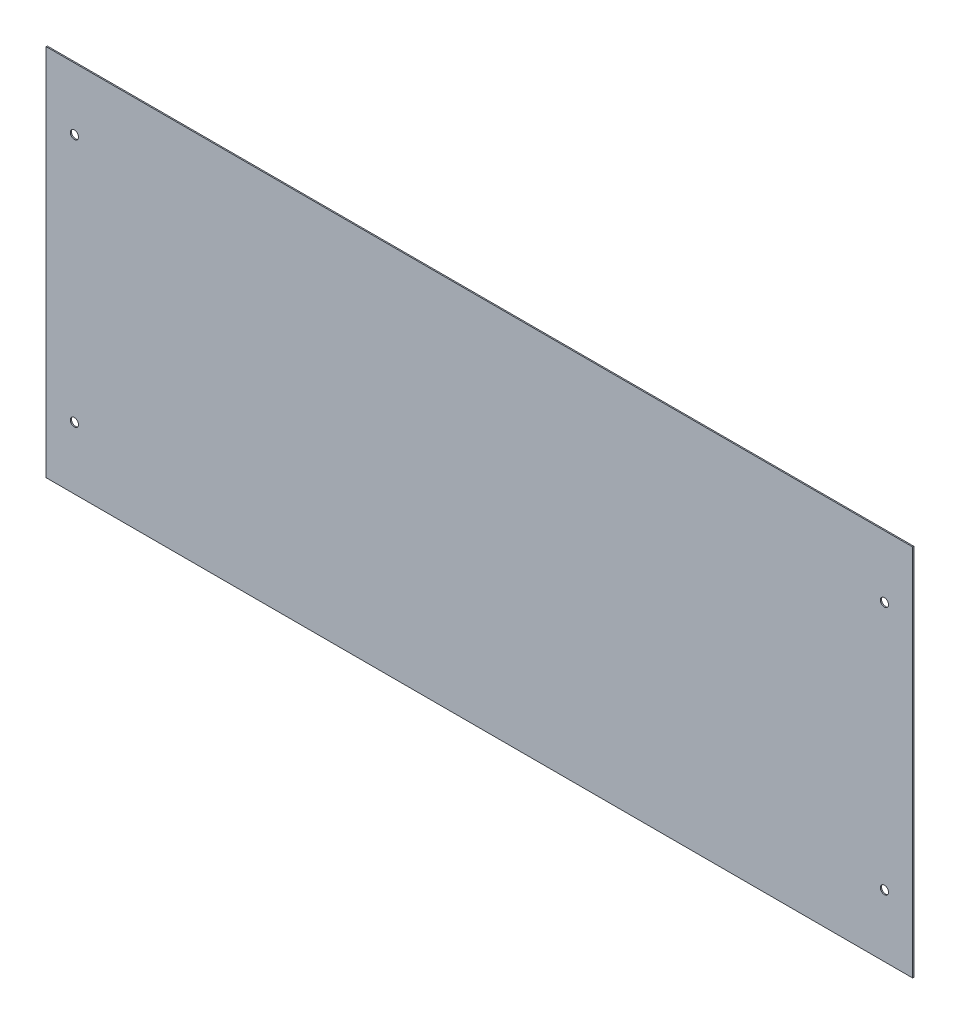
ISO-10303-21;
HEADER;
FILE_DESCRIPTION(('STEP AP214'),'2;1');
FILE_NAME('part.step','',(''),(''),'','','');
FILE_SCHEMA(('AUTOMOTIVE_DESIGN { 1 0 10303 214 1 1 1 1 }'));
ENDSEC;
DATA;
#1=APPLICATION_CONTEXT('core data for automotive mechanical design processes');
#2=APPLICATION_PROTOCOL_DEFINITION('international standard','automotive_design',2000,#1);
#3=PRODUCT_CONTEXT('',#1,'mechanical');
#4=PRODUCT('Part','Part','',(#3));
#5=PRODUCT_RELATED_PRODUCT_CATEGORY('part','',(#4));
#6=PRODUCT_DEFINITION_FORMATION('','',#4);
#7=PRODUCT_DEFINITION_CONTEXT('part definition',#1,'design');
#8=PRODUCT_DEFINITION('design','',#6,#7);
#9=PRODUCT_DEFINITION_SHAPE('','',#8);
#10=(LENGTH_UNIT() NAMED_UNIT(*) SI_UNIT(.MILLI.,.METRE.));
#11=(NAMED_UNIT(*) PLANE_ANGLE_UNIT() SI_UNIT($,.RADIAN.));
#12=(NAMED_UNIT(*) SI_UNIT($,.STERADIAN.) SOLID_ANGLE_UNIT());
#13=UNCERTAINTY_MEASURE_WITH_UNIT(LENGTH_MEASURE(1.E-05),#10,'distance_accuracy_value','');
#14=(GEOMETRIC_REPRESENTATION_CONTEXT(3) GLOBAL_UNCERTAINTY_ASSIGNED_CONTEXT((#13)) GLOBAL_UNIT_ASSIGNED_CONTEXT((#10,
#11,#12)) REPRESENTATION_CONTEXT('',''));
#15=CARTESIAN_POINT('',(0.,0.,0.));
#16=DIRECTION('',(0.,0.,1.));
#17=DIRECTION('',(1.,0.,0.));
#18=AXIS2_PLACEMENT_3D('',#15,#16,#17);
#19=CARTESIAN_POINT('',(0.,0.,1.));
#20=DIRECTION('',(0.,0.,-1.));
#21=DIRECTION('',(-1.,0.,0.));
#22=AXIS2_PLACEMENT_3D('',#19,#20,#21);
#23=PLANE('',#22);
#24=DIRECTION('',(0.,-1.,0.));
#25=VECTOR('',#24,1.);
#26=CARTESIAN_POINT('',(0.,0.,1.));
#27=LINE('',#26,#25);
#28=CARTESIAN_POINT('',(0.,318.,1.));
#29=VERTEX_POINT('',#28);
#30=CARTESIAN_POINT('',(0.,0.,1.));
#31=VERTEX_POINT('',#30);
#32=EDGE_CURVE('E98',#29,#31,#27,.T.);
#33=ORIENTED_EDGE('',*,*,#32,.T.);
#34=DIRECTION('',(1.,0.,0.));
#35=VECTOR('',#34,1.);
#36=CARTESIAN_POINT('',(0.,0.,1.));
#37=LINE('',#36,#35);
#38=CARTESIAN_POINT('',(738.,0.,1.));
#39=VERTEX_POINT('',#38);
#40=EDGE_CURVE('E93',#31,#39,#37,.T.);
#41=ORIENTED_EDGE('',*,*,#40,.T.);
#42=DIRECTION('',(0.,1.,0.));
#43=VECTOR('',#42,1.);
#44=CARTESIAN_POINT('',(738.,0.,1.));
#45=LINE('',#44,#43);
#46=CARTESIAN_POINT('',(738.,318.,1.));
#47=VERTEX_POINT('',#46);
#48=EDGE_CURVE('E96',#39,#47,#45,.T.);
#49=ORIENTED_EDGE('',*,*,#48,.T.);
#50=DIRECTION('',(-1.,0.,0.));
#51=VECTOR('',#50,1.);
#52=CARTESIAN_POINT('',(0.,318.,1.));
#53=LINE('',#52,#51);
#54=EDGE_CURVE('E63',#47,#29,#53,.T.);
#55=ORIENTED_EDGE('',*,*,#54,.T.);
#56=EDGE_LOOP('',(#33,#41,#49,#55));
#57=FACE_BOUND('',#56,.T.);
#58=CARTESIAN_POINT('',(24.,265.06,1.));
#59=DIRECTION('',(0.,0.,1.));
#60=DIRECTION('',(1.,0.,0.));
#61=AXIS2_PLACEMENT_3D('',#58,#59,#60);
#62=CIRCLE('',#61,3.5);
#63=CARTESIAN_POINT('',(27.5,265.06,1.));
#64=VERTEX_POINT('',#63);
#65=EDGE_CURVE('E118',#64,#64,#62,.T.);
#66=ORIENTED_EDGE('',*,*,#65,.F.);
#67=EDGE_LOOP('',(#66));
#68=FACE_BOUND('',#67,.T.);
#69=CARTESIAN_POINT('',(714.,265.06,1.));
#70=DIRECTION('',(0.,0.,1.));
#71=DIRECTION('',(1.,0.,0.));
#72=AXIS2_PLACEMENT_3D('',#69,#70,#71);
#73=CIRCLE('',#72,3.49999999999997);
#74=CARTESIAN_POINT('',(717.5,265.06,1.));
#75=VERTEX_POINT('',#74);
#76=EDGE_CURVE('E140',#75,#75,#73,.T.);
#77=ORIENTED_EDGE('',*,*,#76,.F.);
#78=EDGE_LOOP('',(#77));
#79=FACE_BOUND('',#78,.T.);
#80=CARTESIAN_POINT('',(714.,52.94,1.));
#81=DIRECTION('',(0.,0.,1.));
#82=DIRECTION('',(1.,0.,0.));
#83=AXIS2_PLACEMENT_3D('',#80,#81,#82);
#84=CIRCLE('',#83,3.49999999999996);
#85=CARTESIAN_POINT('',(717.5,52.94,1.));
#86=VERTEX_POINT('',#85);
#87=EDGE_CURVE('E148',#86,#86,#84,.T.);
#88=ORIENTED_EDGE('',*,*,#87,.F.);
#89=EDGE_LOOP('',(#88));
#90=FACE_BOUND('',#89,.T.);
#91=CARTESIAN_POINT('',(24.,52.94,1.));
#92=DIRECTION('',(0.,0.,1.));
#93=DIRECTION('',(1.,0.,0.));
#94=AXIS2_PLACEMENT_3D('',#91,#92,#93);
#95=CIRCLE('',#94,3.5);
#96=CARTESIAN_POINT('',(27.5,52.94,1.));
#97=VERTEX_POINT('',#96);
#98=EDGE_CURVE('E156',#97,#97,#95,.T.);
#99=ORIENTED_EDGE('',*,*,#98,.F.);
#100=EDGE_LOOP('',(#99));
#101=FACE_BOUND('',#100,.T.);
#102=ADVANCED_FACE('F45',(#57,#68,#79,#90,#101),#23,.F.);
#103=CARTESIAN_POINT('',(0.,0.,0.));
#104=DIRECTION('',(0.,0.,-1.));
#105=DIRECTION('',(-1.,0.,0.));
#106=AXIS2_PLACEMENT_3D('',#103,#104,#105);
#107=PLANE('',#106);
#108=CARTESIAN_POINT('',(714.,52.94,0.));
#109=DIRECTION('',(0.,0.,1.));
#110=DIRECTION('',(1.,0.,0.));
#111=AXIS2_PLACEMENT_3D('',#108,#109,#110);
#112=CIRCLE('',#111,3.49999999999996);
#113=CARTESIAN_POINT('',(717.5,52.94,0.));
#114=VERTEX_POINT('',#113);
#115=EDGE_CURVE('E152',#114,#114,#112,.T.);
#116=ORIENTED_EDGE('',*,*,#115,.T.);
#117=EDGE_LOOP('',(#116));
#118=FACE_BOUND('',#117,.T.);
#119=CARTESIAN_POINT('',(24.,265.06,0.));
#120=DIRECTION('',(0.,0.,1.));
#121=DIRECTION('',(1.,0.,0.));
#122=AXIS2_PLACEMENT_3D('',#119,#120,#121);
#123=CIRCLE('',#122,3.5);
#124=CARTESIAN_POINT('',(27.5,265.06,0.));
#125=VERTEX_POINT('',#124);
#126=EDGE_CURVE('E136',#125,#125,#123,.T.);
#127=ORIENTED_EDGE('',*,*,#126,.T.);
#128=EDGE_LOOP('',(#127));
#129=FACE_BOUND('',#128,.T.);
#130=DIRECTION('',(0.,-1.,0.));
#131=VECTOR('',#130,1.);
#132=CARTESIAN_POINT('',(0.,0.,0.));
#133=LINE('',#132,#131);
#134=CARTESIAN_POINT('',(0.,318.,0.));
#135=VERTEX_POINT('',#134);
#136=CARTESIAN_POINT('',(0.,0.,0.));
#137=VERTEX_POINT('',#136);
#138=EDGE_CURVE('E114',#135,#137,#133,.T.);
#139=ORIENTED_EDGE('',*,*,#138,.F.);
#140=DIRECTION('',(-1.,0.,0.));
#141=VECTOR('',#140,1.);
#142=CARTESIAN_POINT('',(0.,318.,0.));
#143=LINE('',#142,#141);
#144=CARTESIAN_POINT('',(738.,318.,0.));
#145=VERTEX_POINT('',#144);
#146=EDGE_CURVE('E86',#145,#135,#143,.T.);
#147=ORIENTED_EDGE('',*,*,#146,.F.);
#148=DIRECTION('',(0.,1.,0.));
#149=VECTOR('',#148,1.);
#150=CARTESIAN_POINT('',(738.,0.,0.));
#151=LINE('',#150,#149);
#152=CARTESIAN_POINT('',(738.,0.,0.));
#153=VERTEX_POINT('',#152);
#154=EDGE_CURVE('E80',#153,#145,#151,.T.);
#155=ORIENTED_EDGE('',*,*,#154,.F.);
#156=DIRECTION('',(1.,0.,0.));
#157=VECTOR('',#156,1.);
#158=CARTESIAN_POINT('',(0.,0.,0.));
#159=LINE('',#158,#157);
#160=EDGE_CURVE('E103',#137,#153,#159,.T.);
#161=ORIENTED_EDGE('',*,*,#160,.F.);
#162=EDGE_LOOP('',(#139,#147,#155,#161));
#163=FACE_BOUND('',#162,.T.);
#164=CARTESIAN_POINT('',(714.,265.06,0.));
#165=DIRECTION('',(0.,0.,1.));
#166=DIRECTION('',(1.,0.,0.));
#167=AXIS2_PLACEMENT_3D('',#164,#165,#166);
#168=CIRCLE('',#167,3.49999999999997);
#169=CARTESIAN_POINT('',(717.5,265.06,0.));
#170=VERTEX_POINT('',#169);
#171=EDGE_CURVE('E144',#170,#170,#168,.T.);
#172=ORIENTED_EDGE('',*,*,#171,.T.);
#173=EDGE_LOOP('',(#172));
#174=FACE_BOUND('',#173,.T.);
#175=CARTESIAN_POINT('',(24.,52.94,0.));
#176=DIRECTION('',(0.,0.,1.));
#177=DIRECTION('',(1.,0.,0.));
#178=AXIS2_PLACEMENT_3D('',#175,#176,#177);
#179=CIRCLE('',#178,3.5);
#180=CARTESIAN_POINT('',(27.5,52.94,0.));
#181=VERTEX_POINT('',#180);
#182=EDGE_CURVE('E160',#181,#181,#179,.T.);
#183=ORIENTED_EDGE('',*,*,#182,.T.);
#184=EDGE_LOOP('',(#183));
#185=FACE_BOUND('',#184,.T.);
#186=ADVANCED_FACE('F131',(#118,#129,#163,#174,#185),#107,.T.);
#187=CARTESIAN_POINT('',(0.,0.,1.));
#188=DIRECTION('',(1.,0.,0.));
#189=DIRECTION('',(0.,0.,-1.));
#190=AXIS2_PLACEMENT_3D('',#187,#188,#189);
#191=PLANE('',#190);
#192=ORIENTED_EDGE('',*,*,#138,.T.);
#193=DIRECTION('',(0.,0.,-1.));
#194=VECTOR('',#193,1.);
#195=CARTESIAN_POINT('',(0.,0.,1.));
#196=LINE('',#195,#194);
#197=EDGE_CURVE('E11',#31,#137,#196,.T.);
#198=ORIENTED_EDGE('',*,*,#197,.F.);
#199=ORIENTED_EDGE('',*,*,#32,.F.);
#200=DIRECTION('',(0.,0.,-1.));
#201=VECTOR('',#200,1.);
#202=CARTESIAN_POINT('',(0.,318.,1.));
#203=LINE('',#202,#201);
#204=EDGE_CURVE('E110',#29,#135,#203,.T.);
#205=ORIENTED_EDGE('',*,*,#204,.T.);
#206=EDGE_LOOP('',(#192,#198,#199,#205));
#207=FACE_BOUND('',#206,.T.);
#208=ADVANCED_FACE('F47',(#207),#191,.F.);
#209=CARTESIAN_POINT('',(0.,0.,1.));
#210=DIRECTION('',(0.,1.,0.));
#211=DIRECTION('',(0.,0.,1.));
#212=AXIS2_PLACEMENT_3D('',#209,#210,#211);
#213=PLANE('',#212);
#214=ORIENTED_EDGE('',*,*,#160,.T.);
#215=DIRECTION('',(0.,0.,-1.));
#216=VECTOR('',#215,1.);
#217=CARTESIAN_POINT('',(738.,0.,1.));
#218=LINE('',#217,#216);
#219=EDGE_CURVE('E55',#39,#153,#218,.T.);
#220=ORIENTED_EDGE('',*,*,#219,.F.);
#221=ORIENTED_EDGE('',*,*,#40,.F.);
#222=ORIENTED_EDGE('',*,*,#197,.T.);
#223=EDGE_LOOP('',(#214,#220,#221,#222));
#224=FACE_BOUND('',#223,.T.);
#225=ADVANCED_FACE('F102',(#224),#213,.F.);
#226=CARTESIAN_POINT('',(738.,0.,1.));
#227=DIRECTION('',(-1.,0.,0.));
#228=DIRECTION('',(0.,0.,1.));
#229=AXIS2_PLACEMENT_3D('',#226,#227,#228);
#230=PLANE('',#229);
#231=ORIENTED_EDGE('',*,*,#154,.T.);
#232=DIRECTION('',(0.,0.,-1.));
#233=VECTOR('',#232,1.);
#234=CARTESIAN_POINT('',(738.,318.,1.));
#235=LINE('',#234,#233);
#236=EDGE_CURVE('E105',#47,#145,#235,.T.);
#237=ORIENTED_EDGE('',*,*,#236,.F.);
#238=ORIENTED_EDGE('',*,*,#48,.F.);
#239=ORIENTED_EDGE('',*,*,#219,.T.);
#240=EDGE_LOOP('',(#231,#237,#238,#239));
#241=FACE_BOUND('',#240,.T.);
#242=ADVANCED_FACE('F106',(#241),#230,.F.);
#243=CARTESIAN_POINT('',(0.,318.,1.));
#244=DIRECTION('',(0.,-1.,0.));
#245=DIRECTION('',(0.,0.,-1.));
#246=AXIS2_PLACEMENT_3D('',#243,#244,#245);
#247=PLANE('',#246);
#248=ORIENTED_EDGE('',*,*,#146,.T.);
#249=ORIENTED_EDGE('',*,*,#204,.F.);
#250=ORIENTED_EDGE('',*,*,#54,.F.);
#251=ORIENTED_EDGE('',*,*,#236,.T.);
#252=EDGE_LOOP('',(#248,#249,#250,#251));
#253=FACE_BOUND('',#252,.T.);
#254=ADVANCED_FACE('F128',(#253),#247,.F.);
#255=CARTESIAN_POINT('',(24.,265.06,1.));
#256=DIRECTION('',(0.,0.,-1.));
#257=DIRECTION('',(-1.,0.,0.));
#258=AXIS2_PLACEMENT_3D('',#255,#256,#257);
#259=CYLINDRICAL_SURFACE('',#258,3.5);
#260=ORIENTED_EDGE('',*,*,#65,.T.);
#261=EDGE_LOOP('',(#260));
#262=FACE_BOUND('',#261,.T.);
#263=ORIENTED_EDGE('',*,*,#126,.F.);
#264=EDGE_LOOP('',(#263));
#265=FACE_BOUND('',#264,.T.);
#266=ADVANCED_FACE('F179',(#262,#265),#259,.F.);
#267=CARTESIAN_POINT('',(714.,265.06,1.));
#268=DIRECTION('',(0.,0.,-1.));
#269=DIRECTION('',(-1.,0.,0.));
#270=AXIS2_PLACEMENT_3D('',#267,#268,#269);
#271=CYLINDRICAL_SURFACE('',#270,3.49999999999997);
#272=ORIENTED_EDGE('',*,*,#76,.T.);
#273=EDGE_LOOP('',(#272));
#274=FACE_BOUND('',#273,.T.);
#275=ORIENTED_EDGE('',*,*,#171,.F.);
#276=EDGE_LOOP('',(#275));
#277=FACE_BOUND('',#276,.T.);
#278=ADVANCED_FACE('F224',(#274,#277),#271,.F.);
#279=CARTESIAN_POINT('',(714.,52.94,1.));
#280=DIRECTION('',(0.,0.,-1.));
#281=DIRECTION('',(-1.,0.,0.));
#282=AXIS2_PLACEMENT_3D('',#279,#280,#281);
#283=CYLINDRICAL_SURFACE('',#282,3.49999999999996);
#284=ORIENTED_EDGE('',*,*,#87,.T.);
#285=EDGE_LOOP('',(#284));
#286=FACE_BOUND('',#285,.T.);
#287=ORIENTED_EDGE('',*,*,#115,.F.);
#288=EDGE_LOOP('',(#287));
#289=FACE_BOUND('',#288,.T.);
#290=ADVANCED_FACE('F232',(#286,#289),#283,.F.);
#291=CARTESIAN_POINT('',(24.,52.94,1.));
#292=DIRECTION('',(0.,0.,-1.));
#293=DIRECTION('',(-1.,0.,0.));
#294=AXIS2_PLACEMENT_3D('',#291,#292,#293);
#295=CYLINDRICAL_SURFACE('',#294,3.5);
#296=ORIENTED_EDGE('',*,*,#98,.T.);
#297=EDGE_LOOP('',(#296));
#298=FACE_BOUND('',#297,.T.);
#299=ORIENTED_EDGE('',*,*,#182,.F.);
#300=EDGE_LOOP('',(#299));
#301=FACE_BOUND('',#300,.T.);
#302=ADVANCED_FACE('F168',(#298,#301),#295,.F.);
#303=CLOSED_SHELL('',(#102,#186,#208,#225,#242,#254,#266,#278,#290,#302));
#304=MANIFOLD_SOLID_BREP('B2',#303);
#305=ADVANCED_BREP_SHAPE_REPRESENTATION('',(#18,#304),#14);
#306=SHAPE_DEFINITION_REPRESENTATION(#9,#305);
ENDSEC;
END-ISO-10303-21;
